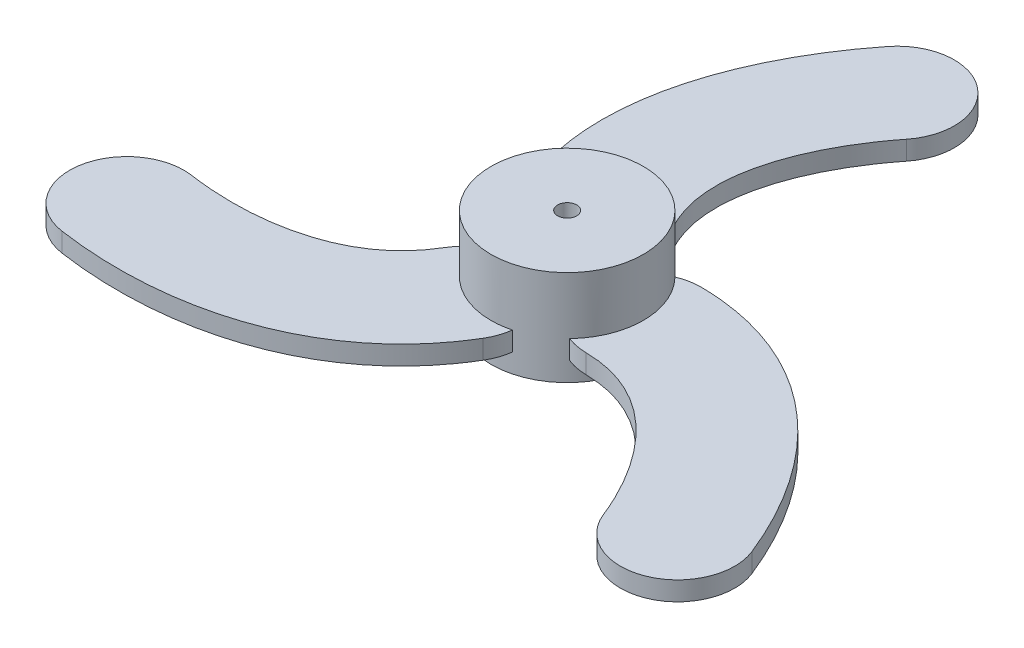
ISO-10303-21;
HEADER;
FILE_DESCRIPTION(('STEP AP214'),'2;1');
FILE_NAME('part.step','',(''),(''),'','','');
FILE_SCHEMA(('AUTOMOTIVE_DESIGN { 1 0 10303 214 1 1 1 1 }'));
ENDSEC;
DATA;
#1=APPLICATION_CONTEXT('core data for automotive mechanical design processes');
#2=APPLICATION_PROTOCOL_DEFINITION('international standard','automotive_design',2000,#1);
#3=PRODUCT_CONTEXT('',#1,'mechanical');
#4=PRODUCT('Part','Part','',(#3));
#5=PRODUCT_RELATED_PRODUCT_CATEGORY('part','',(#4));
#6=PRODUCT_DEFINITION_FORMATION('','',#4);
#7=PRODUCT_DEFINITION_CONTEXT('part definition',#1,'design');
#8=PRODUCT_DEFINITION('design','',#6,#7);
#9=PRODUCT_DEFINITION_SHAPE('','',#8);
#10=(LENGTH_UNIT() NAMED_UNIT(*) SI_UNIT(.MILLI.,.METRE.));
#11=(NAMED_UNIT(*) PLANE_ANGLE_UNIT() SI_UNIT($,.RADIAN.));
#12=(NAMED_UNIT(*) SI_UNIT($,.STERADIAN.) SOLID_ANGLE_UNIT());
#13=UNCERTAINTY_MEASURE_WITH_UNIT(LENGTH_MEASURE(1.E-05),#10,'distance_accuracy_value','');
#14=(GEOMETRIC_REPRESENTATION_CONTEXT(3) GLOBAL_UNCERTAINTY_ASSIGNED_CONTEXT((#13)) GLOBAL_UNIT_ASSIGNED_CONTEXT((#10,
#11,#12)) REPRESENTATION_CONTEXT('',''));
#15=CARTESIAN_POINT('',(0.,0.,0.));
#16=DIRECTION('',(0.,0.,1.));
#17=DIRECTION('',(1.,0.,0.));
#18=AXIS2_PLACEMENT_3D('',#15,#16,#17);
#19=CARTESIAN_POINT('',(0.,5.,0.));
#20=DIRECTION('',(0.,-1.,0.));
#21=DIRECTION('',(0.,0.,-1.));
#22=AXIS2_PLACEMENT_3D('',#19,#20,#21);
#23=CYLINDRICAL_SURFACE('',#22,4.);
#24=DIRECTION('',(0.,-1.,0.));
#25=VECTOR('',#24,1.);
#26=CARTESIAN_POINT('',(0.942978350391452,2.,-3.8872601959083));
#27=LINE('',#26,#25);
#28=CARTESIAN_POINT('',(0.942978350391453,2.,-3.8872601959083));
#29=VERTEX_POINT('',#28);
#30=CARTESIAN_POINT('',(0.942978350391452,1.,-3.8872601959083));
#31=VERTEX_POINT('',#30);
#32=EDGE_CURVE('E59',#29,#31,#27,.T.);
#33=ORIENTED_EDGE('',*,*,#32,.F.);
#34=CARTESIAN_POINT('',(0.,2.,0.));
#35=DIRECTION('',(0.,-1.,0.));
#36=DIRECTION('',(0.,0.,1.));
#37=AXIS2_PLACEMENT_3D('',#34,#35,#36);
#38=CIRCLE('',#37,4.);
#39=CARTESIAN_POINT('',(-3.85380702681341,2.,-1.07152760117675));
#40=VERTEX_POINT('',#39);
#41=EDGE_CURVE('E54',#40,#29,#38,.T.);
#42=ORIENTED_EDGE('',*,*,#41,.F.);
#43=DIRECTION('',(0.,-1.,0.));
#44=VECTOR('',#43,1.);
#45=CARTESIAN_POINT('',(-3.85380702681341,2.,-1.07152760117676));
#46=LINE('',#45,#44);
#47=CARTESIAN_POINT('',(-3.85380702681341,1.,-1.07152760117676));
#48=VERTEX_POINT('',#47);
#49=EDGE_CURVE('E539',#40,#48,#46,.T.);
#50=ORIENTED_EDGE('',*,*,#49,.T.);
#51=CARTESIAN_POINT('',(0.,1.,0.));
#52=DIRECTION('',(0.,-1.,0.));
#53=DIRECTION('',(0.,0.,1.));
#54=AXIS2_PLACEMENT_3D('',#51,#52,#53);
#55=CIRCLE('',#54,4.);
#56=EDGE_CURVE('E529',#48,#31,#55,.T.);
#57=ORIENTED_EDGE('',*,*,#56,.T.);
#58=EDGE_LOOP('',(#33,#42,#50,#57));
#59=FACE_BOUND('',#58,.T.);
#60=DIRECTION('',(0.,-1.,0.));
#61=VECTOR('',#60,1.);
#62=CARTESIAN_POINT('',(-3.83795525597238,2.,1.12698689129643));
#63=LINE('',#62,#61);
#64=CARTESIAN_POINT('',(-3.83795525597238,2.,1.12698689129642));
#65=VERTEX_POINT('',#64);
#66=CARTESIAN_POINT('',(-3.83795525597238,1.,1.12698689129642));
#67=VERTEX_POINT('',#66);
#68=EDGE_CURVE('E348',#65,#67,#63,.T.);
#69=ORIENTED_EDGE('',*,*,#68,.F.);
#70=CARTESIAN_POINT('',(0.,2.,0.));
#71=DIRECTION('',(0.,-1.,0.));
#72=DIRECTION('',(0.,0.,1.));
#73=AXIS2_PLACEMENT_3D('',#70,#71,#72);
#74=CIRCLE('',#73,4.);
#75=CARTESIAN_POINT('',(0.998933389931451,2.,3.87325858709176));
#76=VERTEX_POINT('',#75);
#77=EDGE_CURVE('E418',#76,#65,#74,.T.);
#78=ORIENTED_EDGE('',*,*,#77,.F.);
#79=DIRECTION('',(0.,-1.,0.));
#80=VECTOR('',#79,1.);
#81=CARTESIAN_POINT('',(0.998933389931449,2.,3.87325858709176));
#82=LINE('',#81,#80);
#83=CARTESIAN_POINT('',(0.998933389931449,1.,3.87325858709176));
#84=VERTEX_POINT('',#83);
#85=EDGE_CURVE('E382',#76,#84,#82,.T.);
#86=ORIENTED_EDGE('',*,*,#85,.T.);
#87=CARTESIAN_POINT('',(0.,1.,0.));
#88=DIRECTION('',(0.,-1.,0.));
#89=DIRECTION('',(0.,0.,1.));
#90=AXIS2_PLACEMENT_3D('',#87,#88,#89);
#91=CIRCLE('',#90,4.);
#92=EDGE_CURVE('E394',#84,#67,#91,.T.);
#93=ORIENTED_EDGE('',*,*,#92,.T.);
#94=EDGE_LOOP('',(#69,#78,#86,#93));
#95=FACE_BOUND('',#94,.T.);
#96=DIRECTION('',(0.,-1.,0.));
#97=VECTOR('',#96,1.);
#98=CARTESIAN_POINT('',(2.89497690558096,2.,2.76027330461186));
#99=LINE('',#98,#97);
#100=CARTESIAN_POINT('',(2.89497690558096,2.,2.76027330461186));
#101=VERTEX_POINT('',#100);
#102=CARTESIAN_POINT('',(2.89497690558096,1.,2.76027330461186));
#103=VERTEX_POINT('',#102);
#104=EDGE_CURVE('E304',#101,#103,#99,.T.);
#105=ORIENTED_EDGE('',*,*,#104,.F.);
#106=CARTESIAN_POINT('',(0.,2.,0.));
#107=DIRECTION('',(0.,-1.,0.));
#108=DIRECTION('',(0.,0.,1.));
#109=AXIS2_PLACEMENT_3D('',#106,#107,#108);
#110=CIRCLE('',#109,4.);
#111=CARTESIAN_POINT('',(2.85487363688195,2.,-2.80173098591503));
#112=VERTEX_POINT('',#111);
#113=EDGE_CURVE('E261',#112,#101,#110,.T.);
#114=ORIENTED_EDGE('',*,*,#113,.F.);
#115=DIRECTION('',(0.,-1.,0.));
#116=VECTOR('',#115,1.);
#117=CARTESIAN_POINT('',(2.85487363688195,2.,-2.80173098591504));
#118=LINE('',#117,#116);
#119=CARTESIAN_POINT('',(2.85487363688195,1.,-2.80173098591504));
#120=VERTEX_POINT('',#119);
#121=EDGE_CURVE('E308',#112,#120,#118,.T.);
#122=ORIENTED_EDGE('',*,*,#121,.T.);
#123=CARTESIAN_POINT('',(0.,1.,0.));
#124=DIRECTION('',(0.,-1.,0.));
#125=DIRECTION('',(0.,0.,1.));
#126=AXIS2_PLACEMENT_3D('',#123,#124,#125);
#127=CIRCLE('',#126,4.);
#128=EDGE_CURVE('E294',#120,#103,#127,.T.);
#129=ORIENTED_EDGE('',*,*,#128,.T.);
#130=EDGE_LOOP('',(#105,#114,#122,#129));
#131=FACE_BOUND('',#130,.T.);
#132=CARTESIAN_POINT('',(0.,5.,0.));
#133=DIRECTION('',(0.,1.,0.));
#134=DIRECTION('',(0.,0.,1.));
#135=AXIS2_PLACEMENT_3D('',#132,#133,#134);
#136=CIRCLE('',#135,4.);
#137=CARTESIAN_POINT('',(0.,5.,4.));
#138=VERTEX_POINT('',#137);
#139=EDGE_CURVE('E11',#138,#138,#136,.T.);
#140=ORIENTED_EDGE('',*,*,#139,.F.);
#141=EDGE_LOOP('',(#140));
#142=FACE_BOUND('',#141,.T.);
#143=CARTESIAN_POINT('',(0.,0.,0.));
#144=DIRECTION('',(0.,1.,0.));
#145=DIRECTION('',(0.,0.,1.));
#146=AXIS2_PLACEMENT_3D('',#143,#144,#145);
#147=CIRCLE('',#146,4.);
#148=CARTESIAN_POINT('',(0.,0.,4.));
#149=VERTEX_POINT('',#148);
#150=EDGE_CURVE('E42',#149,#149,#147,.T.);
#151=ORIENTED_EDGE('',*,*,#150,.T.);
#152=EDGE_LOOP('',(#151));
#153=FACE_BOUND('',#152,.T.);
#154=ADVANCED_FACE('F39',(#59,#95,#131,#142,#153),#23,.T.);
#155=CARTESIAN_POINT('',(0.,5.,0.));
#156=DIRECTION('',(0.,1.,0.));
#157=DIRECTION('',(0.,0.,1.));
#158=AXIS2_PLACEMENT_3D('',#155,#156,#157);
#159=PLANE('',#158);
#160=CARTESIAN_POINT('',(0.,5.,0.));
#161=DIRECTION('',(0.,1.,0.));
#162=DIRECTION('',(0.,0.,1.));
#163=AXIS2_PLACEMENT_3D('',#160,#161,#162);
#164=CIRCLE('',#163,0.5);
#165=CARTESIAN_POINT('',(0.,5.,0.5));
#166=VERTEX_POINT('',#165);
#167=EDGE_CURVE('E459',#166,#166,#164,.T.);
#168=ORIENTED_EDGE('',*,*,#167,.F.);
#169=EDGE_LOOP('',(#168));
#170=FACE_BOUND('',#169,.T.);
#171=ORIENTED_EDGE('',*,*,#139,.T.);
#172=EDGE_LOOP('',(#171));
#173=FACE_BOUND('',#172,.T.);
#174=ADVANCED_FACE('F332',(#170,#173),#159,.T.);
#175=CARTESIAN_POINT('',(0.,0.,0.));
#176=DIRECTION('',(0.,1.,0.));
#177=DIRECTION('',(0.,0.,1.));
#178=AXIS2_PLACEMENT_3D('',#175,#176,#177);
#179=PLANE('',#178);
#180=CARTESIAN_POINT('',(0.,0.,0.));
#181=DIRECTION('',(0.,1.,0.));
#182=DIRECTION('',(0.,0.,1.));
#183=AXIS2_PLACEMENT_3D('',#180,#181,#182);
#184=CIRCLE('',#183,0.5);
#185=CARTESIAN_POINT('',(0.,0.,0.5));
#186=VERTEX_POINT('',#185);
#187=EDGE_CURVE('E502',#186,#186,#184,.T.);
#188=ORIENTED_EDGE('',*,*,#187,.T.);
#189=EDGE_LOOP('',(#188));
#190=FACE_BOUND('',#189,.T.);
#191=ORIENTED_EDGE('',*,*,#150,.F.);
#192=EDGE_LOOP('',(#191));
#193=FACE_BOUND('',#192,.T.);
#194=ADVANCED_FACE('F329',(#190,#193),#179,.F.);
#195=CARTESIAN_POINT('',(3.96292250976721,2.,2.97093202502948));
#196=CARTESIAN_POINT('',(4.18223015909482,2.,2.97363508889568));
#197=CARTESIAN_POINT('',(4.62835586974307,2.,3.00214024323476));
#198=CARTESIAN_POINT('',(5.45041080551239,2.,3.14199870179191));
#199=CARTESIAN_POINT('',(6.41994998509663,2.,3.46283261831556));
#200=CARTESIAN_POINT('',(7.51907305774375,2.,4.07472251793139));
#201=CARTESIAN_POINT('',(8.91198555389557,2.,5.1874954559019));
#202=CARTESIAN_POINT('',(10.4731706441016,2.,7.10070053862404));
#203=CARTESIAN_POINT('',(11.4012159099014,2.,8.93871143584327));
#204=CARTESIAN_POINT('',(11.7745775766845,2.,9.87854864811542));
#205=B_SPLINE_CURVE_WITH_KNOTS('',3,(#195,#196,#197,#198,#199,#200,#201,#202,#203,#204),
.UNSPECIFIED.,.F.,.F.,(4,1,1,1,1,1,1,4),(0.,0.0625,0.125,0.25,0.375,0.5,0.75,1.),.UNSPECIFIED.);
#206=DIRECTION('',(0.,-1.,0.));
#207=VECTOR('',#206,1.);
#208=SURFACE_OF_LINEAR_EXTRUSION('',#205,#207);
#209=CARTESIAN_POINT('',(3.96292250976721,1.,2.97093202502948));
#210=CARTESIAN_POINT('',(4.18223015909482,1.,2.97363508889568));
#211=CARTESIAN_POINT('',(4.62835586974307,1.,3.00214024323476));
#212=CARTESIAN_POINT('',(5.45041080551239,1.,3.14199870179191));
#213=CARTESIAN_POINT('',(6.41994998509663,1.,3.46283261831556));
#214=CARTESIAN_POINT('',(7.51907305774375,1.,4.07472251793139));
#215=CARTESIAN_POINT('',(8.91198555389557,1.,5.1874954559019));
#216=CARTESIAN_POINT('',(10.4731706441016,1.,7.10070053862404));
#217=CARTESIAN_POINT('',(11.4012159099014,1.,8.93871143584327));
#218=CARTESIAN_POINT('',(11.7745775766845,1.,9.87854864811542));
#219=B_SPLINE_CURVE_WITH_KNOTS('',3,(#209,#210,#211,#212,#213,#214,#215,#216,#217,#218),
.UNSPECIFIED.,.F.,.F.,(4,1,1,1,1,1,1,4),(0.,0.0625,0.125,0.25,0.375,0.5,0.75,1.),.UNSPECIFIED.);
#220=CARTESIAN_POINT('',(3.96292250976722,1.,2.97093202502948));
#221=VERTEX_POINT('',#220);
#222=CARTESIAN_POINT('',(11.7745775766845,1.,9.87854864811542));
#223=VERTEX_POINT('',#222);
#224=EDGE_CURVE('E269',#221,#223,#219,.T.);
#225=ORIENTED_EDGE('',*,*,#224,.T.);
#226=DIRECTION('',(0.,-1.,0.));
#227=VECTOR('',#226,1.);
#228=CARTESIAN_POINT('',(11.7745775766845,2.,9.87854864811542));
#229=LINE('',#228,#227);
#230=CARTESIAN_POINT('',(11.7745775766845,2.,9.87854864811542));
#231=VERTEX_POINT('',#230);
#232=EDGE_CURVE('E319',#231,#223,#229,.T.);
#233=ORIENTED_EDGE('',*,*,#232,.F.);
#234=CARTESIAN_POINT('',(3.96292250976722,2.,2.97093202502948));
#235=VERTEX_POINT('',#234);
#236=EDGE_CURVE('E300',#235,#231,#205,.T.);
#237=ORIENTED_EDGE('',*,*,#236,.F.);
#238=DIRECTION('',(0.,-1.,0.));
#239=VECTOR('',#238,1.);
#240=CARTESIAN_POINT('',(3.96292250976722,2.,2.97093202502948));
#241=LINE('',#240,#239);
#242=EDGE_CURVE('E268',#235,#221,#241,.T.);
#243=ORIENTED_EDGE('',*,*,#242,.T.);
#244=EDGE_LOOP('',(#225,#233,#237,#243));
#245=FACE_BOUND('',#244,.T.);
#246=ADVANCED_FACE('F331',(#245),#208,.F.);
#247=CARTESIAN_POINT('',(14.5626321265122,2.,8.77096035493722));
#248=DIRECTION('',(0.,-1.,0.));
#249=DIRECTION('',(0.,0.,-1.));
#250=AXIS2_PLACEMENT_3D('',#247,#248,#249);
#251=CYLINDRICAL_SURFACE('',#250,3.);
#252=CARTESIAN_POINT('',(14.5626321265122,1.,8.77096035493722));
#253=DIRECTION('',(0.,1.,0.));
#254=DIRECTION('',(0.,0.,1.));
#255=AXIS2_PLACEMENT_3D('',#252,#253,#254);
#256=CIRCLE('',#255,3.);
#257=CARTESIAN_POINT('',(17.3506866763398,1.,7.66337206175902));
#258=VERTEX_POINT('',#257);
#259=EDGE_CURVE('E275',#223,#258,#256,.T.);
#260=ORIENTED_EDGE('',*,*,#259,.T.);
#261=DIRECTION('',(0.,-1.,0.));
#262=VECTOR('',#261,1.);
#263=CARTESIAN_POINT('',(17.3506866763398,2.,7.66337206175902));
#264=LINE('',#263,#262);
#265=CARTESIAN_POINT('',(17.3506866763398,2.,7.66337206175902));
#266=VERTEX_POINT('',#265);
#267=EDGE_CURVE('E315',#266,#258,#264,.T.);
#268=ORIENTED_EDGE('',*,*,#267,.F.);
#269=CARTESIAN_POINT('',(14.5626321265122,2.,8.77096035493722));
#270=DIRECTION('',(0.,1.,0.));
#271=DIRECTION('',(0.,0.,1.));
#272=AXIS2_PLACEMENT_3D('',#269,#270,#271);
#273=CIRCLE('',#272,3.);
#274=EDGE_CURVE('E253',#231,#266,#273,.T.);
#275=ORIENTED_EDGE('',*,*,#274,.F.);
#276=ORIENTED_EDGE('',*,*,#232,.T.);
#277=EDGE_LOOP('',(#260,#268,#275,#276));
#278=FACE_BOUND('',#277,.T.);
#279=ADVANCED_FACE('F242',(#278),#251,.T.);
#280=CARTESIAN_POINT('',(17.3506866763398,2.,7.66337206175902));
#281=CARTESIAN_POINT('',(17.0951686141278,2.,7.02017431373185));
#282=CARTESIAN_POINT('',(16.5316281524233,2.,5.76825703048924));
#283=CARTESIAN_POINT('',(15.1163095847058,2.,3.28914075250374));
#284=CARTESIAN_POINT('',(12.8100789715133,2.,0.41937163969633));
#285=CARTESIAN_POINT('',(9.64078978947195,2.,-1.79653032784298));
#286=CARTESIAN_POINT('',(6.95415956161075,2.,-2.69203901087497));
#287=CARTESIAN_POINT('',(5.31869822728264,2.,-2.96868622307214));
#288=CARTESIAN_POINT('',(4.46169618287094,2.,-3.02337610094657));
#289=CARTESIAN_POINT('',(4.03686954931161,2.,-3.02861227727737));
#290=B_SPLINE_CURVE_WITH_KNOTS('',3,(#280,#281,#282,#283,#284,#285,#286,#287,#288,#289),
.UNSPECIFIED.,.F.,.F.,(4,1,1,1,1,1,1,4),(0.,0.125,0.25,0.5,0.75,0.875,0.9375,1.),.UNSPECIFIED.);
#291=DIRECTION('',(0.,-1.,0.));
#292=VECTOR('',#291,1.);
#293=SURFACE_OF_LINEAR_EXTRUSION('',#290,#292);
#294=CARTESIAN_POINT('',(17.3506866763398,1.,7.66337206175902));
#295=CARTESIAN_POINT('',(17.0951686141278,1.,7.02017431373185));
#296=CARTESIAN_POINT('',(16.5316281524233,1.,5.76825703048924));
#297=CARTESIAN_POINT('',(15.1163095847058,1.,3.28914075250374));
#298=CARTESIAN_POINT('',(12.8100789715133,1.,0.41937163969633));
#299=CARTESIAN_POINT('',(9.64078978947195,1.,-1.79653032784298));
#300=CARTESIAN_POINT('',(6.95415956161075,1.,-2.69203901087497));
#301=CARTESIAN_POINT('',(5.31869822728264,1.,-2.96868622307214));
#302=CARTESIAN_POINT('',(4.46169618287094,1.,-3.02337610094657));
#303=CARTESIAN_POINT('',(4.03686954931161,1.,-3.02861227727737));
#304=B_SPLINE_CURVE_WITH_KNOTS('',3,(#294,#295,#296,#297,#298,#299,#300,#301,#302,#303),
.UNSPECIFIED.,.F.,.F.,(4,1,1,1,1,1,1,4),(0.,0.125,0.25,0.5,0.75,0.875,0.9375,1.),.UNSPECIFIED.);
#305=CARTESIAN_POINT('',(4.03686954931161,1.,-3.02861227727737));
#306=VERTEX_POINT('',#305);
#307=EDGE_CURVE('E282',#258,#306,#304,.T.);
#308=ORIENTED_EDGE('',*,*,#307,.T.);
#309=DIRECTION('',(0.,-1.,0.));
#310=VECTOR('',#309,1.);
#311=CARTESIAN_POINT('',(4.03686954931161,2.,-3.02861227727737));
#312=LINE('',#311,#310);
#313=CARTESIAN_POINT('',(4.03686954931161,2.,-3.02861227727737));
#314=VERTEX_POINT('',#313);
#315=EDGE_CURVE('E311',#314,#306,#312,.T.);
#316=ORIENTED_EDGE('',*,*,#315,.F.);
#317=EDGE_CURVE('E245',#266,#314,#290,.T.);
#318=ORIENTED_EDGE('',*,*,#317,.F.);
#319=ORIENTED_EDGE('',*,*,#267,.T.);
#320=EDGE_LOOP('',(#308,#316,#318,#319));
#321=FACE_BOUND('',#320,.T.);
#322=ADVANCED_FACE('F237',(#321),#293,.F.);
#323=CARTESIAN_POINT('',(3.99989602953941,2.,-0.0288401261239459));
#324=DIRECTION('',(0.,-1.,0.));
#325=DIRECTION('',(0.,0.,-1.));
#326=AXIS2_PLACEMENT_3D('',#323,#324,#325);
#327=CYLINDRICAL_SURFACE('',#326,3.);
#328=CARTESIAN_POINT('',(3.99989602953941,1.,-0.0288401261239459));
#329=DIRECTION('',(0.,1.,0.));
#330=DIRECTION('',(0.,0.,-1.));
#331=AXIS2_PLACEMENT_3D('',#328,#329,#330);
#332=CIRCLE('',#331,3.);
#333=EDGE_CURVE('E287',#306,#120,#332,.T.);
#334=ORIENTED_EDGE('',*,*,#333,.T.);
#335=ORIENTED_EDGE('',*,*,#121,.F.);
#336=CARTESIAN_POINT('',(3.99989602953941,2.,-0.0288401261239459));
#337=DIRECTION('',(0.,1.,0.));
#338=DIRECTION('',(0.,0.,-1.));
#339=AXIS2_PLACEMENT_3D('',#336,#337,#338);
#340=CIRCLE('',#339,3.);
#341=EDGE_CURVE('E252',#314,#112,#340,.T.);
#342=ORIENTED_EDGE('',*,*,#341,.F.);
#343=ORIENTED_EDGE('',*,*,#315,.T.);
#344=EDGE_LOOP('',(#334,#335,#342,#343));
#345=FACE_BOUND('',#344,.T.);
#346=ADVANCED_FACE('F233',(#345),#327,.T.);
#347=CARTESIAN_POINT('',(3.99989602953941,2.,-0.0288401261239459));
#348=DIRECTION('',(0.,-1.,0.));
#349=DIRECTION('',(0.,0.,-1.));
#350=AXIS2_PLACEMENT_3D('',#347,#348,#349);
#351=CYLINDRICAL_SURFACE('',#350,3.);
#352=CARTESIAN_POINT('',(3.99989602953941,1.,-0.0288401261239459));
#353=DIRECTION('',(0.,1.,0.));
#354=DIRECTION('',(0.,0.,-1.));
#355=AXIS2_PLACEMENT_3D('',#352,#353,#354);
#356=CIRCLE('',#355,3.);
#357=EDGE_CURVE('E297',#103,#221,#356,.T.);
#358=ORIENTED_EDGE('',*,*,#357,.T.);
#359=ORIENTED_EDGE('',*,*,#242,.F.);
#360=CARTESIAN_POINT('',(3.99989602953941,2.,-0.0288401261239459));
#361=DIRECTION('',(0.,1.,0.));
#362=DIRECTION('',(0.,0.,-1.));
#363=AXIS2_PLACEMENT_3D('',#360,#361,#362);
#364=CIRCLE('',#363,3.);
#365=EDGE_CURVE('E265',#101,#235,#364,.T.);
#366=ORIENTED_EDGE('',*,*,#365,.F.);
#367=ORIENTED_EDGE('',*,*,#104,.T.);
#368=EDGE_LOOP('',(#358,#359,#366,#367));
#369=FACE_BOUND('',#368,.T.);
#370=ADVANCED_FACE('F226',(#369),#351,.T.);
#371=CARTESIAN_POINT('',(8.55176039452536,2.,4.94411814875988));
#372=DIRECTION('',(0.,1.,0.));
#373=DIRECTION('',(0.,0.,1.));
#374=AXIS2_PLACEMENT_3D('',#371,#372,#373);
#375=PLANE('',#374);
#376=ORIENTED_EDGE('',*,*,#236,.T.);
#377=ORIENTED_EDGE('',*,*,#274,.T.);
#378=ORIENTED_EDGE('',*,*,#317,.T.);
#379=ORIENTED_EDGE('',*,*,#341,.T.);
#380=ORIENTED_EDGE('',*,*,#113,.T.);
#381=ORIENTED_EDGE('',*,*,#365,.T.);
#382=EDGE_LOOP('',(#376,#377,#378,#379,#380,#381));
#383=FACE_BOUND('',#382,.T.);
#384=ADVANCED_FACE('F223',(#383),#375,.T.);
#385=CARTESIAN_POINT('',(8.55176039452536,1.,4.94411814875988));
#386=DIRECTION('',(0.,1.,0.));
#387=DIRECTION('',(0.,0.,1.));
#388=AXIS2_PLACEMENT_3D('',#385,#386,#387);
#389=PLANE('',#388);
#390=ORIENTED_EDGE('',*,*,#224,.F.);
#391=ORIENTED_EDGE('',*,*,#357,.F.);
#392=ORIENTED_EDGE('',*,*,#128,.F.);
#393=ORIENTED_EDGE('',*,*,#333,.F.);
#394=ORIENTED_EDGE('',*,*,#307,.F.);
#395=ORIENTED_EDGE('',*,*,#259,.F.);
#396=EDGE_LOOP('',(#390,#391,#392,#393,#394,#395));
#397=FACE_BOUND('',#396,.T.);
#398=ADVANCED_FACE('F220',(#397),#389,.F.);
#399=CARTESIAN_POINT('',(-4.55436386147589,2.,1.94652555417282));
#400=CARTESIAN_POINT('',(-4.66635860811587,2.,2.13510001780167));
#401=CARTESIAN_POINT('',(-4.91410765123644,2.,2.50720363933489));
#402=CARTESIAN_POINT('',(-5.44625609716572,2.,3.14919486773893));
#403=CARTESIAN_POINT('',(-6.20887600906298,2.,3.82842346896138));
#404=CARTESIAN_POINT('',(-7.28834974277296,2.,4.47434702195148));
#405=CARTESIAN_POINT('',(-8.94849562377516,2.,5.1242581598825));
#406=CARTESIAN_POINT('',(-11.385972373165,2.,5.51968156664934));
#407=CARTESIAN_POINT('',(-13.4417591354893,2.,5.40438689408423));
#408=CARTESIAN_POINT('',(-14.4423628701304,2.,5.25780897618159));
#409=B_SPLINE_CURVE_WITH_KNOTS('',3,(#399,#400,#401,#402,#403,#404,#405,#406,#407,#408),
.UNSPECIFIED.,.F.,.F.,(4,1,1,1,1,1,1,4),(0.,0.0625,0.125,0.25,0.375,0.5,0.75,1.),.UNSPECIFIED.);
#410=DIRECTION('',(0.,-1.,0.));
#411=VECTOR('',#410,1.);
#412=SURFACE_OF_LINEAR_EXTRUSION('',#409,#411);
#413=CARTESIAN_POINT('',(-4.55436386147589,1.,1.94652555417282));
#414=CARTESIAN_POINT('',(-4.66635860811587,1.,2.13510001780167));
#415=CARTESIAN_POINT('',(-4.91410765123644,1.,2.50720363933489));
#416=CARTESIAN_POINT('',(-5.44625609716572,1.,3.14919486773893));
#417=CARTESIAN_POINT('',(-6.20887600906298,1.,3.82842346896138));
#418=CARTESIAN_POINT('',(-7.28834974277296,1.,4.47434702195148));
#419=CARTESIAN_POINT('',(-8.94849562377516,1.,5.1242581598825));
#420=CARTESIAN_POINT('',(-11.385972373165,1.,5.51968156664934));
#421=CARTESIAN_POINT('',(-13.4417591354893,1.,5.40438689408423));
#422=CARTESIAN_POINT('',(-14.4423628701304,1.,5.25780897618159));
#423=B_SPLINE_CURVE_WITH_KNOTS('',3,(#413,#414,#415,#416,#417,#418,#419,#420,#421,#422),
.UNSPECIFIED.,.F.,.F.,(4,1,1,1,1,1,1,4),(0.,0.0625,0.125,0.25,0.375,0.5,0.75,1.),.UNSPECIFIED.);
#424=CARTESIAN_POINT('',(-4.55436386147589,1.,1.94652555417282));
#425=VERTEX_POINT('',#424);
#426=CARTESIAN_POINT('',(-14.4423628701305,1.,5.25780897618167));
#427=VERTEX_POINT('',#426);
#428=EDGE_CURVE('E190',#425,#427,#423,.T.);
#429=ORIENTED_EDGE('',*,*,#428,.T.);
#430=DIRECTION('',(0.,-1.,0.));
#431=VECTOR('',#430,1.);
#432=CARTESIAN_POINT('',(-14.4423628701305,2.,5.25780897618167));
#433=LINE('',#432,#431);
#434=CARTESIAN_POINT('',(-14.4423628701305,2.,5.25780897618167));
#435=VERTEX_POINT('',#434);
#436=EDGE_CURVE('E276',#435,#427,#433,.T.);
#437=ORIENTED_EDGE('',*,*,#436,.F.);
#438=CARTESIAN_POINT('',(-4.55436386147589,2.,1.94652555417282));
#439=VERTEX_POINT('',#438);
#440=EDGE_CURVE('E201',#439,#435,#409,.T.);
#441=ORIENTED_EDGE('',*,*,#440,.F.);
#442=DIRECTION('',(0.,-1.,0.));
#443=VECTOR('',#442,1.);
#444=CARTESIAN_POINT('',(-4.55436386147589,2.,1.94652555417282));
#445=LINE('',#444,#443);
#446=EDGE_CURVE('E387',#439,#425,#445,.T.);
#447=ORIENTED_EDGE('',*,*,#446,.T.);
#448=EDGE_LOOP('',(#429,#437,#441,#447));
#449=FACE_BOUND('',#448,.T.);
#450=ADVANCED_FACE('F215',(#449),#412,.F.);
#451=CARTESIAN_POINT('',(-14.8771905462179,2.,8.22612919005826));
#452=DIRECTION('',(0.,-1.,0.));
#453=DIRECTION('',(0.,0.,-1.));
#454=AXIS2_PLACEMENT_3D('',#451,#452,#453);
#455=CYLINDRICAL_SURFACE('',#454,3.);
#456=CARTESIAN_POINT('',(-14.8771905462179,1.,8.22612919005826));
#457=DIRECTION('',(0.,1.,0.));
#458=DIRECTION('',(0.,0.,1.));
#459=AXIS2_PLACEMENT_3D('',#456,#457,#458);
#460=CIRCLE('',#459,3.);
#461=CARTESIAN_POINT('',(-15.3120182223052,1.,11.1944494039348));
#462=VERTEX_POINT('',#461);
#463=EDGE_CURVE('E195',#427,#462,#460,.T.);
#464=ORIENTED_EDGE('',*,*,#463,.T.);
#465=DIRECTION('',(0.,-1.,0.));
#466=VECTOR('',#465,1.);
#467=CARTESIAN_POINT('',(-15.3120182223052,2.,11.1944494039348));
#468=LINE('',#467,#466);
#469=CARTESIAN_POINT('',(-15.3120182223052,2.,11.1944494039348));
#470=VERTEX_POINT('',#469);
#471=EDGE_CURVE('E374',#470,#462,#468,.T.);
#472=ORIENTED_EDGE('',*,*,#471,.F.);
#473=CARTESIAN_POINT('',(-14.8771905462179,2.,8.22612919005826));
#474=DIRECTION('',(0.,1.,0.));
#475=DIRECTION('',(0.,0.,1.));
#476=AXIS2_PLACEMENT_3D('',#473,#474,#475);
#477=CIRCLE('',#476,3.);
#478=EDGE_CURVE('E208',#435,#470,#477,.T.);
#479=ORIENTED_EDGE('',*,*,#478,.F.);
#480=ORIENTED_EDGE('',*,*,#436,.T.);
#481=EDGE_LOOP('',(#464,#472,#479,#480));
#482=FACE_BOUND('',#481,.T.);
#483=ADVANCED_FACE('F219',(#482),#455,.T.);
#484=CARTESIAN_POINT('',(-15.3120182223052,2.,11.1944494039348));
#485=CARTESIAN_POINT('',(-14.6272336017507,2.,11.294763144947));
#486=CARTESIAN_POINT('',(-13.2612712001735,2.,11.4326814306718));
#487=CARTESIAN_POINT('',(-10.4066342406438,2.,11.4465377355736));
#488=CARTESIAN_POINT('',(-6.76822597936036,2.,10.8841679939671));
#489=CARTESIAN_POINT('',(-3.26455399215476,2.,9.24743403414977));
#490=CARTESIAN_POINT('',(-1.14570560940893,2.,7.36849834776281));
#491=CARTESIAN_POINT('',(-0.0883914285960022,2.,6.09047089142609));
#492=CARTESIAN_POINT('',(0.387472417178976,2.,5.37563028880759));
#493=CARTESIAN_POINT('',(0.604420395679808,2.,5.0103377201064));
#494=B_SPLINE_CURVE_WITH_KNOTS('',3,(#484,#485,#486,#487,#488,#489,#490,#491,#492,#493),
.UNSPECIFIED.,.F.,.F.,(4,1,1,1,1,1,1,4),(0.,0.125,0.25,0.5,0.75,0.875,0.9375,1.),.UNSPECIFIED.);
#495=DIRECTION('',(0.,-1.,0.));
#496=VECTOR('',#495,1.);
#497=SURFACE_OF_LINEAR_EXTRUSION('',#494,#496);
#498=CARTESIAN_POINT('',(-15.3120182223052,1.,11.1944494039348));
#499=CARTESIAN_POINT('',(-14.6272336017507,1.,11.294763144947));
#500=CARTESIAN_POINT('',(-13.2612712001735,1.,11.4326814306718));
#501=CARTESIAN_POINT('',(-10.4066342406438,1.,11.4465377355736));
#502=CARTESIAN_POINT('',(-6.76822597936036,1.,10.8841679939671));
#503=CARTESIAN_POINT('',(-3.26455399215476,1.,9.24743403414977));
#504=CARTESIAN_POINT('',(-1.14570560940893,1.,7.36849834776281));
#505=CARTESIAN_POINT('',(-0.0883914285960022,1.,6.09047089142609));
#506=CARTESIAN_POINT('',(0.387472417178976,1.,5.37563028880759));
#507=CARTESIAN_POINT('',(0.604420395679808,1.,5.0103377201064));
#508=B_SPLINE_CURVE_WITH_KNOTS('',3,(#498,#499,#500,#501,#502,#503,#504,#505,#506,#507),
.UNSPECIFIED.,.F.,.F.,(4,1,1,1,1,1,1,4),(0.,0.125,0.25,0.5,0.75,0.875,0.9375,1.),.UNSPECIFIED.);
#509=CARTESIAN_POINT('',(0.604420395679808,1.,5.0103377201064));
#510=VERTEX_POINT('',#509);
#511=EDGE_CURVE('E401',#462,#510,#508,.T.);
#512=ORIENTED_EDGE('',*,*,#511,.T.);
#513=DIRECTION('',(0.,-1.,0.));
#514=VECTOR('',#513,1.);
#515=CARTESIAN_POINT('',(0.604420395679808,2.,5.0103377201064));
#516=LINE('',#515,#514);
#517=CARTESIAN_POINT('',(0.604420395679808,2.,5.0103377201064));
#518=VERTEX_POINT('',#517);
#519=EDGE_CURVE('E378',#518,#510,#516,.T.);
#520=ORIENTED_EDGE('',*,*,#519,.F.);
#521=EDGE_CURVE('E424',#470,#518,#494,.T.);
#522=ORIENTED_EDGE('',*,*,#521,.F.);
#523=ORIENTED_EDGE('',*,*,#471,.T.);
#524=EDGE_LOOP('',(#512,#520,#522,#523));
#525=FACE_BOUND('',#524,.T.);
#526=ADVANCED_FACE('F432',(#525),#497,.F.);
#527=CARTESIAN_POINT('',(-1.97497173289804,2.,3.47843163713961));
#528=DIRECTION('',(0.,-1.,0.));
#529=DIRECTION('',(0.,0.,-1.));
#530=AXIS2_PLACEMENT_3D('',#527,#528,#529);
#531=CYLINDRICAL_SURFACE('',#530,3.);
#532=CARTESIAN_POINT('',(-1.97497173289804,1.,3.47843163713961));
#533=DIRECTION('',(0.,1.,0.));
#534=DIRECTION('',(0.,0.,-1.));
#535=AXIS2_PLACEMENT_3D('',#532,#533,#534);
#536=CIRCLE('',#535,3.);
#537=EDGE_CURVE('E397',#510,#84,#536,.T.);
#538=ORIENTED_EDGE('',*,*,#537,.T.);
#539=ORIENTED_EDGE('',*,*,#85,.F.);
#540=CARTESIAN_POINT('',(-1.97497173289804,2.,3.47843163713961));
#541=DIRECTION('',(0.,1.,0.));
#542=DIRECTION('',(0.,0.,-1.));
#543=AXIS2_PLACEMENT_3D('',#540,#541,#542);
#544=CIRCLE('',#543,3.);
#545=EDGE_CURVE('E421',#518,#76,#544,.T.);
#546=ORIENTED_EDGE('',*,*,#545,.F.);
#547=ORIENTED_EDGE('',*,*,#519,.T.);
#548=EDGE_LOOP('',(#538,#539,#546,#547));
#549=FACE_BOUND('',#548,.T.);
#550=ADVANCED_FACE('F435',(#549),#531,.T.);
#551=CARTESIAN_POINT('',(-1.97497173289804,2.,3.47843163713961));
#552=DIRECTION('',(0.,-1.,0.));
#553=DIRECTION('',(0.,0.,-1.));
#554=AXIS2_PLACEMENT_3D('',#551,#552,#553);
#555=CYLINDRICAL_SURFACE('',#554,3.);
#556=CARTESIAN_POINT('',(-1.97497173289804,1.,3.47843163713961));
#557=DIRECTION('',(0.,1.,0.));
#558=DIRECTION('',(0.,0.,-1.));
#559=AXIS2_PLACEMENT_3D('',#556,#557,#558);
#560=CIRCLE('',#559,3.);
#561=EDGE_CURVE('E209',#67,#425,#560,.T.);
#562=ORIENTED_EDGE('',*,*,#561,.T.);
#563=ORIENTED_EDGE('',*,*,#446,.F.);
#564=CARTESIAN_POINT('',(-1.97497173289804,2.,3.47843163713961));
#565=DIRECTION('',(0.,1.,0.));
#566=DIRECTION('',(0.,0.,-1.));
#567=AXIS2_PLACEMENT_3D('',#564,#565,#566);
#568=CIRCLE('',#567,3.);
#569=EDGE_CURVE('E391',#65,#439,#568,.T.);
#570=ORIENTED_EDGE('',*,*,#569,.F.);
#571=ORIENTED_EDGE('',*,*,#68,.T.);
#572=EDGE_LOOP('',(#562,#563,#570,#571));
#573=FACE_BOUND('',#572,.T.);
#574=ADVANCED_FACE('F439',(#573),#555,.T.);
#575=CARTESIAN_POINT('',(-8.55761211340042,2.,4.93398267435662));
#576=DIRECTION('',(0.,1.,0.));
#577=DIRECTION('',(0.,0.,1.));
#578=AXIS2_PLACEMENT_3D('',#575,#576,#577);
#579=PLANE('',#578);
#580=ORIENTED_EDGE('',*,*,#440,.T.);
#581=ORIENTED_EDGE('',*,*,#478,.T.);
#582=ORIENTED_EDGE('',*,*,#521,.T.);
#583=ORIENTED_EDGE('',*,*,#545,.T.);
#584=ORIENTED_EDGE('',*,*,#77,.T.);
#585=ORIENTED_EDGE('',*,*,#569,.T.);
#586=EDGE_LOOP('',(#580,#581,#582,#583,#584,#585));
#587=FACE_BOUND('',#586,.T.);
#588=ADVANCED_FACE('F443',(#587),#579,.T.);
#589=CARTESIAN_POINT('',(-8.55761211340042,1.,4.93398267435662));
#590=DIRECTION('',(0.,1.,0.));
#591=DIRECTION('',(0.,0.,1.));
#592=AXIS2_PLACEMENT_3D('',#589,#590,#591);
#593=PLANE('',#592);
#594=ORIENTED_EDGE('',*,*,#428,.F.);
#595=ORIENTED_EDGE('',*,*,#561,.F.);
#596=ORIENTED_EDGE('',*,*,#92,.F.);
#597=ORIENTED_EDGE('',*,*,#537,.F.);
#598=ORIENTED_EDGE('',*,*,#511,.F.);
#599=ORIENTED_EDGE('',*,*,#463,.F.);
#600=EDGE_LOOP('',(#594,#595,#596,#597,#598,#599));
#601=FACE_BOUND('',#600,.T.);
#602=ADVANCED_FACE('F445',(#601),#593,.F.);
#603=CARTESIAN_POINT('',(0.591441351708721,2.,-4.91745757920231));
#604=CARTESIAN_POINT('',(0.484128449021101,2.,-5.10873510669737));
#605=CARTESIAN_POINT('',(0.285751781493428,2.,-5.50934388256968));
#606=CARTESIAN_POINT('',(-0.00415470834660156,2.,-6.29119356953086));
#607=CARTESIAN_POINT('',(-0.211073976033576,2.,-7.29125608727697));
#608=CARTESIAN_POINT('',(-0.230723314970712,2.,-8.5490695398829));
#609=CARTESIAN_POINT('',(0.0365100698796793,2.,-10.3117536157844));
#610=CARTESIAN_POINT('',(0.912801729063535,2.,-12.6203821052733));
#611=CARTESIAN_POINT('',(2.0405432255881,2.,-14.3430983299274));
#612=CARTESIAN_POINT('',(2.66778529344618,2.,-15.1363576242969));
#613=B_SPLINE_CURVE_WITH_KNOTS('',3,(#603,#604,#605,#606,#607,#608,#609,#610,#611,#612),
.UNSPECIFIED.,.F.,.F.,(4,1,1,1,1,1,1,4),(0.,0.0625,0.125,0.25,0.375,0.5,0.75,1.),.UNSPECIFIED.);
#614=DIRECTION('',(0.,-1.,0.));
#615=VECTOR('',#614,1.);
#616=SURFACE_OF_LINEAR_EXTRUSION('',#613,#615);
#617=CARTESIAN_POINT('',(0.591441351708721,1.,-4.91745757920231));
#618=CARTESIAN_POINT('',(0.484128449021101,1.,-5.10873510669737));
#619=CARTESIAN_POINT('',(0.285751781493428,1.,-5.50934388256968));
#620=CARTESIAN_POINT('',(-0.00415470834660156,1.,-6.29119356953086));
#621=CARTESIAN_POINT('',(-0.211073976033576,1.,-7.29125608727697));
#622=CARTESIAN_POINT('',(-0.230723314970712,1.,-8.5490695398829));
#623=CARTESIAN_POINT('',(0.0365100698796793,1.,-10.3117536157844));
#624=CARTESIAN_POINT('',(0.912801729063535,1.,-12.6203821052733));
#625=CARTESIAN_POINT('',(2.0405432255881,1.,-14.3430983299274));
#626=CARTESIAN_POINT('',(2.66778529344618,1.,-15.1363576242969));
#627=B_SPLINE_CURVE_WITH_KNOTS('',3,(#617,#618,#619,#620,#621,#622,#623,#624,#625,#626),
.UNSPECIFIED.,.F.,.F.,(4,1,1,1,1,1,1,4),(0.,0.0625,0.125,0.25,0.375,0.5,0.75,1.),.UNSPECIFIED.);
#628=CARTESIAN_POINT('',(0.591441351708721,1.,-4.91745757920231));
#629=VERTEX_POINT('',#628);
#630=CARTESIAN_POINT('',(2.66778529344612,1.,-15.1363576242969));
#631=VERTEX_POINT('',#630);
#632=EDGE_CURVE('E188',#629,#631,#627,.T.);
#633=ORIENTED_EDGE('',*,*,#632,.T.);
#634=DIRECTION('',(0.,-1.,0.));
#635=VECTOR('',#634,1.);
#636=CARTESIAN_POINT('',(2.66778529344612,2.,-15.1363576242969));
#637=LINE('',#636,#635);
#638=CARTESIAN_POINT('',(2.66778529344612,2.,-15.1363576242969));
#639=VERTEX_POINT('',#638);
#640=EDGE_CURVE('E166',#639,#631,#637,.T.);
#641=ORIENTED_EDGE('',*,*,#640,.F.);
#642=CARTESIAN_POINT('',(0.591441351708721,2.,-4.91745757920231));
#643=VERTEX_POINT('',#642);
#644=EDGE_CURVE('E174',#643,#639,#613,.T.);
#645=ORIENTED_EDGE('',*,*,#644,.F.);
#646=DIRECTION('',(0.,-1.,0.));
#647=VECTOR('',#646,1.);
#648=CARTESIAN_POINT('',(0.591441351708721,2.,-4.91745757920231));
#649=LINE('',#648,#647);
#650=EDGE_CURVE('E534',#643,#629,#649,.T.);
#651=ORIENTED_EDGE('',*,*,#650,.T.);
#652=EDGE_LOOP('',(#633,#641,#645,#651));
#653=FACE_BOUND('',#652,.T.);
#654=ADVANCED_FACE('F186',(#653),#616,.F.);
#655=CARTESIAN_POINT('',(0.314558419705881,2.,-16.9970895449955));
#656=DIRECTION('',(0.,-1.,0.));
#657=DIRECTION('',(0.,0.,-1.));
#658=AXIS2_PLACEMENT_3D('',#655,#656,#657);
#659=CYLINDRICAL_SURFACE('',#658,3.);
#660=CARTESIAN_POINT('',(0.314558419705881,1.,-16.9970895449955));
#661=DIRECTION('',(0.,1.,0.));
#662=DIRECTION('',(0.,0.,1.));
#663=AXIS2_PLACEMENT_3D('',#660,#661,#662);
#664=CIRCLE('',#663,3.);
#665=CARTESIAN_POINT('',(-2.03866845403443,1.,-18.8578214656939));
#666=VERTEX_POINT('',#665);
#667=EDGE_CURVE('E506',#631,#666,#664,.T.);
#668=ORIENTED_EDGE('',*,*,#667,.T.);
#669=DIRECTION('',(0.,-1.,0.));
#670=VECTOR('',#669,1.);
#671=CARTESIAN_POINT('',(-2.03866845403443,2.,-18.8578214656939));
#672=LINE('',#671,#670);
#673=CARTESIAN_POINT('',(-2.03866845403443,2.,-18.8578214656939));
#674=VERTEX_POINT('',#673);
#675=EDGE_CURVE('E169',#674,#666,#672,.T.);
#676=ORIENTED_EDGE('',*,*,#675,.F.);
#677=CARTESIAN_POINT('',(0.314558419705881,2.,-16.9970895449955));
#678=DIRECTION('',(0.,1.,0.));
#679=DIRECTION('',(0.,0.,1.));
#680=AXIS2_PLACEMENT_3D('',#677,#678,#679);
#681=CIRCLE('',#680,3.);
#682=EDGE_CURVE('E162',#639,#674,#681,.T.);
#683=ORIENTED_EDGE('',*,*,#682,.F.);
#684=ORIENTED_EDGE('',*,*,#640,.T.);
#685=EDGE_LOOP('',(#668,#676,#683,#684));
#686=FACE_BOUND('',#685,.T.);
#687=ADVANCED_FACE('F164',(#686),#659,.T.);
#688=CARTESIAN_POINT('',(-2.03866845403443,2.,-18.8578214656939));
#689=CARTESIAN_POINT('',(-2.46793501237691,2.,-18.3149374586789));
#690=CARTESIAN_POINT('',(-3.27035695224961,2.,-17.2009384611611));
#691=CARTESIAN_POINT('',(-4.70967534406193,2.,-14.7356784880773));
#692=CARTESIAN_POINT('',(-6.04185299215282,2.,-11.3035396336635));
#693=CARTESIAN_POINT('',(-6.3762357973171,2.,-7.45090370630684));
#694=CARTESIAN_POINT('',(-5.80845395220177,2.,-4.6764593368879));
#695=CARTESIAN_POINT('',(-5.23030679868663,2.,-3.12178466835401));
#696=CARTESIAN_POINT('',(-4.84916860004993,2.,-2.35225418786106));
#697=CARTESIAN_POINT('',(-4.64128994499144,2.,-1.98172544282906));
#698=B_SPLINE_CURVE_WITH_KNOTS('',3,(#688,#689,#690,#691,#692,#693,#694,#695,#696,#697),
.UNSPECIFIED.,.F.,.F.,(4,1,1,1,1,1,1,4),(0.,0.125,0.25,0.5,0.75,0.875,0.9375,1.),.UNSPECIFIED.);
#699=DIRECTION('',(0.,-1.,0.));
#700=VECTOR('',#699,1.);
#701=SURFACE_OF_LINEAR_EXTRUSION('',#698,#700);
#702=CARTESIAN_POINT('',(-2.03866845403443,1.,-18.8578214656939));
#703=CARTESIAN_POINT('',(-2.46793501237691,1.,-18.3149374586789));
#704=CARTESIAN_POINT('',(-3.27035695224961,1.,-17.2009384611611));
#705=CARTESIAN_POINT('',(-4.70967534406193,1.,-14.7356784880773));
#706=CARTESIAN_POINT('',(-6.04185299215282,1.,-11.3035396336635));
#707=CARTESIAN_POINT('',(-6.3762357973171,1.,-7.45090370630684));
#708=CARTESIAN_POINT('',(-5.80845395220177,1.,-4.6764593368879));
#709=CARTESIAN_POINT('',(-5.23030679868663,1.,-3.12178466835401));
#710=CARTESIAN_POINT('',(-4.84916860004993,1.,-2.35225418786106));
#711=CARTESIAN_POINT('',(-4.64128994499144,1.,-1.98172544282906));
#712=B_SPLINE_CURVE_WITH_KNOTS('',3,(#702,#703,#704,#705,#706,#707,#708,#709,#710,#711),
.UNSPECIFIED.,.F.,.F.,(4,1,1,1,1,1,1,4),(0.,0.125,0.25,0.5,0.75,0.875,0.9375,1.),.UNSPECIFIED.);
#713=CARTESIAN_POINT('',(-4.64128994499144,1.,-1.98172544282906));
#714=VERTEX_POINT('',#713);
#715=EDGE_CURVE('E509',#666,#714,#712,.T.);
#716=ORIENTED_EDGE('',*,*,#715,.T.);
#717=DIRECTION('',(0.,-1.,0.));
#718=VECTOR('',#717,1.);
#719=CARTESIAN_POINT('',(-4.64128994499144,2.,-1.98172544282906));
#720=LINE('',#719,#718);
#721=CARTESIAN_POINT('',(-4.64128994499144,2.,-1.98172544282906));
#722=VERTEX_POINT('',#721);
#723=EDGE_CURVE('E197',#722,#714,#720,.T.);
#724=ORIENTED_EDGE('',*,*,#723,.F.);
#725=EDGE_CURVE('E173',#674,#722,#698,.T.);
#726=ORIENTED_EDGE('',*,*,#725,.F.);
#727=ORIENTED_EDGE('',*,*,#675,.T.);
#728=EDGE_LOOP('',(#716,#724,#726,#727));
#729=FACE_BOUND('',#728,.T.);
#730=ADVANCED_FACE('F475',(#729),#701,.F.);
#731=CARTESIAN_POINT('',(-2.02492429664136,2.,-3.44959151101569));
#732=DIRECTION('',(0.,-1.,0.));
#733=DIRECTION('',(0.,0.,-1.));
#734=AXIS2_PLACEMENT_3D('',#731,#732,#733);
#735=CYLINDRICAL_SURFACE('',#734,3.);
#736=CARTESIAN_POINT('',(-2.02492429664136,1.,-3.44959151101569));
#737=DIRECTION('',(0.,1.,0.));
#738=DIRECTION('',(0.,0.,-1.));
#739=AXIS2_PLACEMENT_3D('',#736,#737,#738);
#740=CIRCLE('',#739,3.);
#741=EDGE_CURVE('E522',#714,#48,#740,.T.);
#742=ORIENTED_EDGE('',*,*,#741,.T.);
#743=ORIENTED_EDGE('',*,*,#49,.F.);
#744=CARTESIAN_POINT('',(-2.02492429664136,2.,-3.44959151101569));
#745=DIRECTION('',(0.,1.,0.));
#746=DIRECTION('',(0.,0.,-1.));
#747=AXIS2_PLACEMENT_3D('',#744,#745,#746);
#748=CIRCLE('',#747,3.);
#749=EDGE_CURVE('E470',#722,#40,#748,.T.);
#750=ORIENTED_EDGE('',*,*,#749,.F.);
#751=ORIENTED_EDGE('',*,*,#723,.T.);
#752=EDGE_LOOP('',(#742,#743,#750,#751));
#753=FACE_BOUND('',#752,.T.);
#754=ADVANCED_FACE('F478',(#753),#735,.T.);
#755=CARTESIAN_POINT('',(-2.02492429664136,2.,-3.44959151101569));
#756=DIRECTION('',(0.,-1.,0.));
#757=DIRECTION('',(0.,0.,-1.));
#758=AXIS2_PLACEMENT_3D('',#755,#756,#757);
#759=CYLINDRICAL_SURFACE('',#758,3.);
#760=CARTESIAN_POINT('',(-2.02492429664136,1.,-3.44959151101569));
#761=DIRECTION('',(0.,1.,0.));
#762=DIRECTION('',(0.,0.,-1.));
#763=AXIS2_PLACEMENT_3D('',#760,#761,#762);
#764=CIRCLE('',#763,3.);
#765=EDGE_CURVE('E184',#31,#629,#764,.T.);
#766=ORIENTED_EDGE('',*,*,#765,.T.);
#767=ORIENTED_EDGE('',*,*,#650,.F.);
#768=CARTESIAN_POINT('',(-2.02492429664136,2.,-3.44959151101569));
#769=DIRECTION('',(0.,1.,0.));
#770=DIRECTION('',(0.,0.,-1.));
#771=AXIS2_PLACEMENT_3D('',#768,#769,#770);
#772=CIRCLE('',#771,3.);
#773=EDGE_CURVE('E179',#29,#643,#772,.T.);
#774=ORIENTED_EDGE('',*,*,#773,.F.);
#775=ORIENTED_EDGE('',*,*,#32,.T.);
#776=EDGE_LOOP('',(#766,#767,#774,#775));
#777=FACE_BOUND('',#776,.T.);
#778=ADVANCED_FACE('F482',(#777),#759,.T.);
#779=CARTESIAN_POINT('',(0.00585171887513917,2.,-9.8781008231165));
#780=DIRECTION('',(0.,1.,0.));
#781=DIRECTION('',(0.,0.,1.));
#782=AXIS2_PLACEMENT_3D('',#779,#780,#781);
#783=PLANE('',#782);
#784=ORIENTED_EDGE('',*,*,#644,.T.);
#785=ORIENTED_EDGE('',*,*,#682,.T.);
#786=ORIENTED_EDGE('',*,*,#725,.T.);
#787=ORIENTED_EDGE('',*,*,#749,.T.);
#788=ORIENTED_EDGE('',*,*,#41,.T.);
#789=ORIENTED_EDGE('',*,*,#773,.T.);
#790=EDGE_LOOP('',(#784,#785,#786,#787,#788,#789));
#791=FACE_BOUND('',#790,.T.);
#792=ADVANCED_FACE('F177',(#791),#783,.T.);
#793=CARTESIAN_POINT('',(0.00585171887513917,1.,-9.8781008231165));
#794=DIRECTION('',(0.,1.,0.));
#795=DIRECTION('',(0.,0.,1.));
#796=AXIS2_PLACEMENT_3D('',#793,#794,#795);
#797=PLANE('',#796);
#798=ORIENTED_EDGE('',*,*,#632,.F.);
#799=ORIENTED_EDGE('',*,*,#765,.F.);
#800=ORIENTED_EDGE('',*,*,#56,.F.);
#801=ORIENTED_EDGE('',*,*,#741,.F.);
#802=ORIENTED_EDGE('',*,*,#715,.F.);
#803=ORIENTED_EDGE('',*,*,#667,.F.);
#804=EDGE_LOOP('',(#798,#799,#800,#801,#802,#803));
#805=FACE_BOUND('',#804,.T.);
#806=ADVANCED_FACE('F487',(#805),#797,.F.);
#807=CARTESIAN_POINT('',(0.,0.,0.));
#808=DIRECTION('',(0.,1.,0.));
#809=DIRECTION('',(0.,0.,1.));
#810=AXIS2_PLACEMENT_3D('',#807,#808,#809);
#811=CYLINDRICAL_SURFACE('',#810,0.5);
#812=ORIENTED_EDGE('',*,*,#167,.T.);
#813=EDGE_LOOP('',(#812));
#814=FACE_BOUND('',#813,.T.);
#815=ORIENTED_EDGE('',*,*,#187,.F.);
#816=EDGE_LOOP('',(#815));
#817=FACE_BOUND('',#816,.T.);
#818=ADVANCED_FACE('F490',(#814,#817),#811,.F.);
#819=CLOSED_SHELL('',(#154,#174,#194,#246,#279,#322,#346,#370,#384,#398,#450,#483,#526,#550,
#574,#588,#602,#654,#687,#730,#754,#778,#792,#806,#818));
#820=MANIFOLD_SOLID_BREP('B2',#819);
#821=ADVANCED_BREP_SHAPE_REPRESENTATION('',(#18,#820),#14);
#822=SHAPE_DEFINITION_REPRESENTATION(#9,#821);
ENDSEC;
END-ISO-10303-21;
